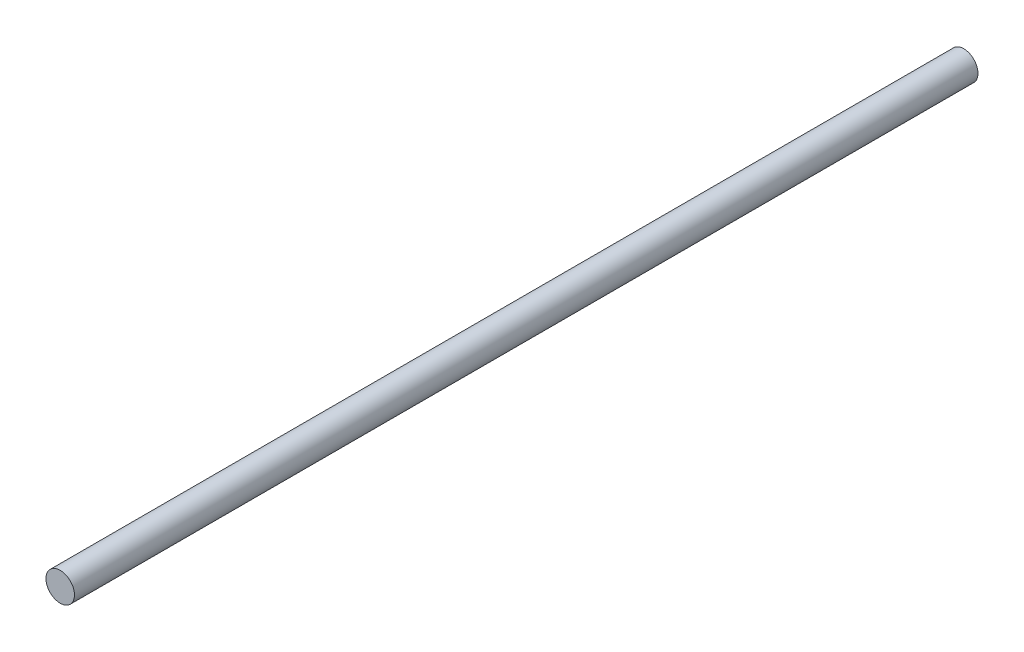
ISO-10303-21;
HEADER;
FILE_DESCRIPTION(('STEP AP214'),'2;1');
FILE_NAME('part.step','',(''),(''),'','','');
FILE_SCHEMA(('AUTOMOTIVE_DESIGN { 1 0 10303 214 1 1 1 1 }'));
ENDSEC;
DATA;
#1=APPLICATION_CONTEXT('core data for automotive mechanical design processes');
#2=APPLICATION_PROTOCOL_DEFINITION('international standard','automotive_design',2000,#1);
#3=PRODUCT_CONTEXT('',#1,'mechanical');
#4=PRODUCT('Part','Part','',(#3));
#5=PRODUCT_RELATED_PRODUCT_CATEGORY('part','',(#4));
#6=PRODUCT_DEFINITION_FORMATION('','',#4);
#7=PRODUCT_DEFINITION_CONTEXT('part definition',#1,'design');
#8=PRODUCT_DEFINITION('design','',#6,#7);
#9=PRODUCT_DEFINITION_SHAPE('','',#8);
#10=(LENGTH_UNIT() NAMED_UNIT(*) SI_UNIT(.MILLI.,.METRE.));
#11=(NAMED_UNIT(*) PLANE_ANGLE_UNIT() SI_UNIT($,.RADIAN.));
#12=(NAMED_UNIT(*) SI_UNIT($,.STERADIAN.) SOLID_ANGLE_UNIT());
#13=UNCERTAINTY_MEASURE_WITH_UNIT(LENGTH_MEASURE(1.E-05),#10,'distance_accuracy_value','');
#14=(GEOMETRIC_REPRESENTATION_CONTEXT(3) GLOBAL_UNCERTAINTY_ASSIGNED_CONTEXT((#13)) GLOBAL_UNIT_ASSIGNED_CONTEXT((#10,
#11,#12)) REPRESENTATION_CONTEXT('',''));
#15=CARTESIAN_POINT('',(0.,0.,0.));
#16=DIRECTION('',(0.,0.,1.));
#17=DIRECTION('',(1.,0.,0.));
#18=AXIS2_PLACEMENT_3D('',#15,#16,#17);
#19=CARTESIAN_POINT('',(0.,0.,252.));
#20=DIRECTION('',(0.,0.,-1.));
#21=DIRECTION('',(-1.,0.,0.));
#22=AXIS2_PLACEMENT_3D('',#19,#20,#21);
#23=CYLINDRICAL_SURFACE('',#22,3.975);
#24=CARTESIAN_POINT('',(0.,0.,252.));
#25=DIRECTION('',(0.,0.,1.));
#26=DIRECTION('',(1.,0.,0.));
#27=AXIS2_PLACEMENT_3D('',#24,#25,#26);
#28=CIRCLE('',#27,3.975);
#29=CARTESIAN_POINT('',(3.975,0.,252.));
#30=VERTEX_POINT('',#29);
#31=EDGE_CURVE('E10',#30,#30,#28,.T.);
#32=ORIENTED_EDGE('',*,*,#31,.F.);
#33=EDGE_LOOP('',(#32));
#34=FACE_BOUND('',#33,.T.);
#35=CARTESIAN_POINT('',(0.,0.,0.));
#36=DIRECTION('',(0.,0.,1.));
#37=DIRECTION('',(1.,0.,0.));
#38=AXIS2_PLACEMENT_3D('',#35,#36,#37);
#39=CIRCLE('',#38,3.975);
#40=CARTESIAN_POINT('',(3.975,0.,0.));
#41=VERTEX_POINT('',#40);
#42=EDGE_CURVE('E34',#41,#41,#39,.T.);
#43=ORIENTED_EDGE('',*,*,#42,.T.);
#44=EDGE_LOOP('',(#43));
#45=FACE_BOUND('',#44,.T.);
#46=ADVANCED_FACE('F31',(#34,#45),#23,.T.);
#47=CARTESIAN_POINT('',(0.,0.,252.));
#48=DIRECTION('',(0.,0.,1.));
#49=DIRECTION('',(1.,0.,0.));
#50=AXIS2_PLACEMENT_3D('',#47,#48,#49);
#51=PLANE('',#50);
#52=ORIENTED_EDGE('',*,*,#31,.T.);
#53=EDGE_LOOP('',(#52));
#54=FACE_BOUND('',#53,.T.);
#55=ADVANCED_FACE('F46',(#54),#51,.T.);
#56=CARTESIAN_POINT('',(0.,0.,0.));
#57=DIRECTION('',(0.,0.,1.));
#58=DIRECTION('',(1.,0.,0.));
#59=AXIS2_PLACEMENT_3D('',#56,#57,#58);
#60=PLANE('',#59);
#61=ORIENTED_EDGE('',*,*,#42,.F.);
#62=EDGE_LOOP('',(#61));
#63=FACE_BOUND('',#62,.T.);
#64=ADVANCED_FACE('F44',(#63),#60,.F.);
#65=CLOSED_SHELL('',(#46,#55,#64));
#66=MANIFOLD_SOLID_BREP('B2',#65);
#67=ADVANCED_BREP_SHAPE_REPRESENTATION('',(#18,#66),#14);
#68=SHAPE_DEFINITION_REPRESENTATION(#9,#67);
ENDSEC;
END-ISO-10303-21;
